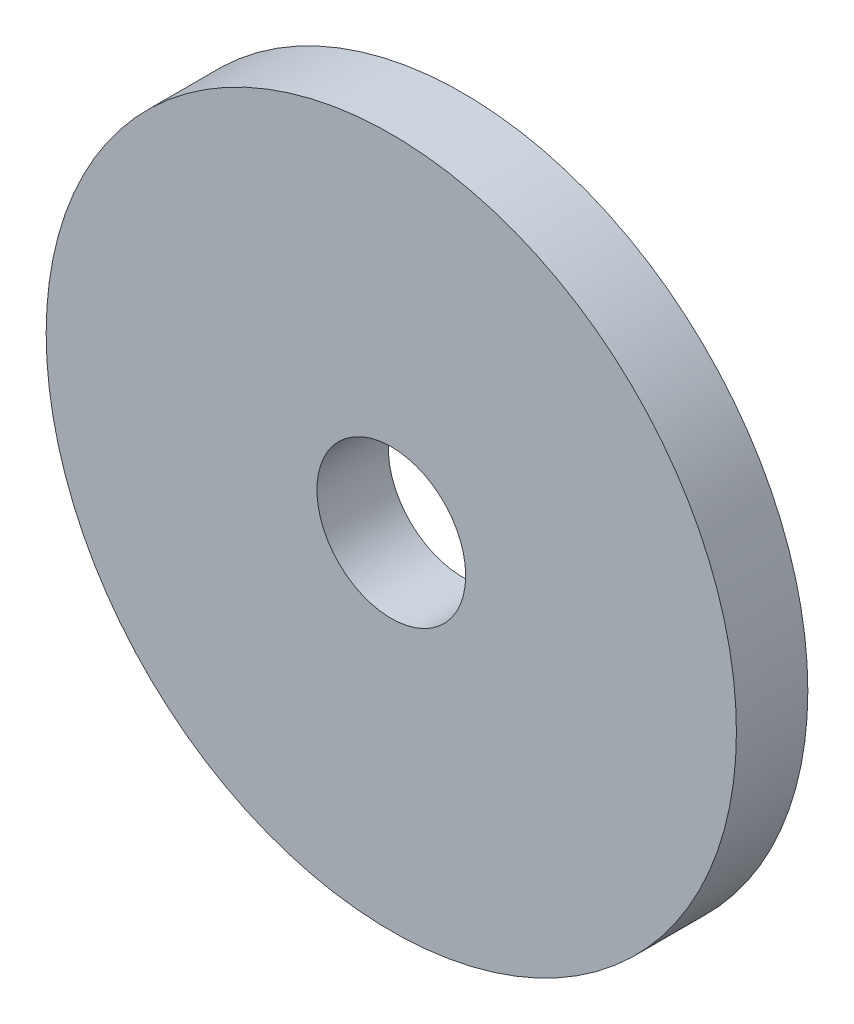
ISO-10303-21;
HEADER;
FILE_DESCRIPTION(('STEP AP214'),'2;1');
FILE_NAME('part.step','',(''),(''),'','','');
FILE_SCHEMA(('AUTOMOTIVE_DESIGN { 1 0 10303 214 1 1 1 1 }'));
ENDSEC;
DATA;
#1=APPLICATION_CONTEXT('core data for automotive mechanical design processes');
#2=APPLICATION_PROTOCOL_DEFINITION('international standard','automotive_design',2000,#1);
#3=PRODUCT_CONTEXT('',#1,'mechanical');
#4=PRODUCT('Part','Part','',(#3));
#5=PRODUCT_RELATED_PRODUCT_CATEGORY('part','',(#4));
#6=PRODUCT_DEFINITION_FORMATION('','',#4);
#7=PRODUCT_DEFINITION_CONTEXT('part definition',#1,'design');
#8=PRODUCT_DEFINITION('design','',#6,#7);
#9=PRODUCT_DEFINITION_SHAPE('','',#8);
#10=(LENGTH_UNIT() NAMED_UNIT(*) SI_UNIT(.MILLI.,.METRE.));
#11=(NAMED_UNIT(*) PLANE_ANGLE_UNIT() SI_UNIT($,.RADIAN.));
#12=(NAMED_UNIT(*) SI_UNIT($,.STERADIAN.) SOLID_ANGLE_UNIT());
#13=UNCERTAINTY_MEASURE_WITH_UNIT(LENGTH_MEASURE(1.E-05),#10,'distance_accuracy_value','');
#14=(GEOMETRIC_REPRESENTATION_CONTEXT(3) GLOBAL_UNCERTAINTY_ASSIGNED_CONTEXT((#13)) GLOBAL_UNIT_ASSIGNED_CONTEXT((#10,
#11,#12)) REPRESENTATION_CONTEXT('',''));
#15=CARTESIAN_POINT('',(0.,0.,0.));
#16=DIRECTION('',(0.,0.,1.));
#17=DIRECTION('',(1.,0.,0.));
#18=AXIS2_PLACEMENT_3D('',#15,#16,#17);
#19=CARTESIAN_POINT('',(0.,0.,3.048));
#20=DIRECTION('',(0.,0.,-1.));
#21=DIRECTION('',(-1.,0.,0.));
#22=AXIS2_PLACEMENT_3D('',#19,#20,#21);
#23=CYLINDRICAL_SURFACE('',#22,14.732);
#24=CARTESIAN_POINT('',(0.,0.,3.048));
#25=DIRECTION('',(0.,0.,1.));
#26=DIRECTION('',(1.,0.,0.));
#27=AXIS2_PLACEMENT_3D('',#24,#25,#26);
#28=CIRCLE('',#27,14.732);
#29=CARTESIAN_POINT('',(14.732,0.,3.048));
#30=VERTEX_POINT('',#29);
#31=EDGE_CURVE('E10',#30,#30,#28,.T.);
#32=ORIENTED_EDGE('',*,*,#31,.F.);
#33=EDGE_LOOP('',(#32));
#34=FACE_BOUND('',#33,.T.);
#35=CARTESIAN_POINT('',(0.,0.,0.));
#36=DIRECTION('',(0.,0.,1.));
#37=DIRECTION('',(1.,0.,0.));
#38=AXIS2_PLACEMENT_3D('',#35,#36,#37);
#39=CIRCLE('',#38,14.732);
#40=CARTESIAN_POINT('',(14.732,0.,0.));
#41=VERTEX_POINT('',#40);
#42=EDGE_CURVE('E42',#41,#41,#39,.T.);
#43=ORIENTED_EDGE('',*,*,#42,.T.);
#44=EDGE_LOOP('',(#43));
#45=FACE_BOUND('',#44,.T.);
#46=ADVANCED_FACE('F39',(#34,#45),#23,.T.);
#47=CARTESIAN_POINT('',(0.,0.,3.048));
#48=DIRECTION('',(0.,0.,1.));
#49=DIRECTION('',(1.,0.,0.));
#50=AXIS2_PLACEMENT_3D('',#47,#48,#49);
#51=PLANE('',#50);
#52=CARTESIAN_POINT('',(0.,0.,3.048));
#53=DIRECTION('',(0.,0.,1.));
#54=DIRECTION('',(1.,0.,0.));
#55=AXIS2_PLACEMENT_3D('',#52,#53,#54);
#56=CIRCLE('',#55,3.175);
#57=CARTESIAN_POINT('',(3.175,0.,3.048));
#58=VERTEX_POINT('',#57);
#59=EDGE_CURVE('E51',#58,#58,#56,.T.);
#60=ORIENTED_EDGE('',*,*,#59,.F.);
#61=EDGE_LOOP('',(#60));
#62=FACE_BOUND('',#61,.T.);
#63=ORIENTED_EDGE('',*,*,#31,.T.);
#64=EDGE_LOOP('',(#63));
#65=FACE_BOUND('',#64,.T.);
#66=ADVANCED_FACE('F66',(#62,#65),#51,.T.);
#67=CARTESIAN_POINT('',(0.,0.,0.));
#68=DIRECTION('',(0.,0.,1.));
#69=DIRECTION('',(1.,0.,0.));
#70=AXIS2_PLACEMENT_3D('',#67,#68,#69);
#71=PLANE('',#70);
#72=CARTESIAN_POINT('',(0.,0.,0.));
#73=DIRECTION('',(0.,0.,1.));
#74=DIRECTION('',(1.,0.,0.));
#75=AXIS2_PLACEMENT_3D('',#72,#73,#74);
#76=CIRCLE('',#75,3.175);
#77=CARTESIAN_POINT('',(3.175,0.,0.));
#78=VERTEX_POINT('',#77);
#79=EDGE_CURVE('E49',#78,#78,#76,.T.);
#80=ORIENTED_EDGE('',*,*,#79,.T.);
#81=EDGE_LOOP('',(#80));
#82=FACE_BOUND('',#81,.T.);
#83=ORIENTED_EDGE('',*,*,#42,.F.);
#84=EDGE_LOOP('',(#83));
#85=FACE_BOUND('',#84,.T.);
#86=ADVANCED_FACE('F57',(#82,#85),#71,.F.);
#87=CARTESIAN_POINT('',(0.,0.,0.));
#88=DIRECTION('',(0.,0.,1.));
#89=DIRECTION('',(1.,0.,0.));
#90=AXIS2_PLACEMENT_3D('',#87,#88,#89);
#91=CYLINDRICAL_SURFACE('',#90,3.175);
#92=ORIENTED_EDGE('',*,*,#79,.F.);
#93=EDGE_LOOP('',(#92));
#94=FACE_BOUND('',#93,.T.);
#95=ORIENTED_EDGE('',*,*,#59,.T.);
#96=EDGE_LOOP('',(#95));
#97=FACE_BOUND('',#96,.T.);
#98=ADVANCED_FACE('F60',(#94,#97),#91,.F.);
#99=CLOSED_SHELL('',(#46,#66,#86,#98));
#100=MANIFOLD_SOLID_BREP('B2',#99);
#101=ADVANCED_BREP_SHAPE_REPRESENTATION('',(#18,#100),#14);
#102=SHAPE_DEFINITION_REPRESENTATION(#9,#101);
ENDSEC;
END-ISO-10303-21;
